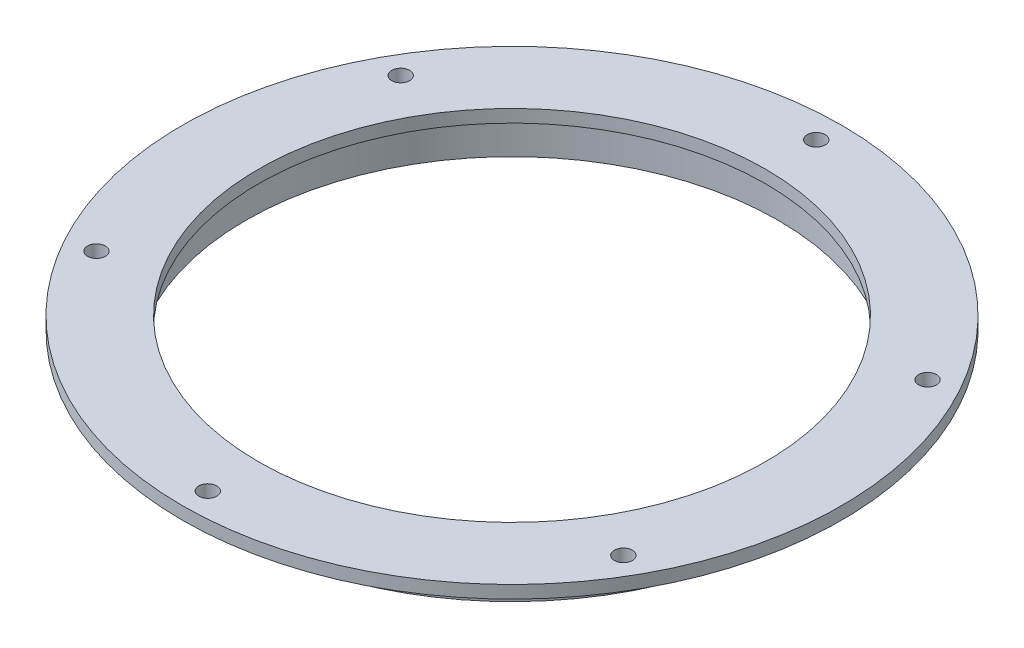
ISO-10303-21;
HEADER;
FILE_DESCRIPTION(('STEP AP214'),'2;1');
FILE_NAME('part.step','',(''),(''),'','','');
FILE_SCHEMA(('AUTOMOTIVE_DESIGN { 1 0 10303 214 1 1 1 1 }'));
ENDSEC;
DATA;
#1=APPLICATION_CONTEXT('core data for automotive mechanical design processes');
#2=APPLICATION_PROTOCOL_DEFINITION('international standard','automotive_design',2000,#1);
#3=PRODUCT_CONTEXT('',#1,'mechanical');
#4=PRODUCT('Part','Part','',(#3));
#5=PRODUCT_RELATED_PRODUCT_CATEGORY('part','',(#4));
#6=PRODUCT_DEFINITION_FORMATION('','',#4);
#7=PRODUCT_DEFINITION_CONTEXT('part definition',#1,'design');
#8=PRODUCT_DEFINITION('design','',#6,#7);
#9=PRODUCT_DEFINITION_SHAPE('','',#8);
#10=(LENGTH_UNIT() NAMED_UNIT(*) SI_UNIT(.MILLI.,.METRE.));
#11=(NAMED_UNIT(*) PLANE_ANGLE_UNIT() SI_UNIT($,.RADIAN.));
#12=(NAMED_UNIT(*) SI_UNIT($,.STERADIAN.) SOLID_ANGLE_UNIT());
#13=UNCERTAINTY_MEASURE_WITH_UNIT(LENGTH_MEASURE(1.E-05),#10,'distance_accuracy_value','');
#14=(GEOMETRIC_REPRESENTATION_CONTEXT(3) GLOBAL_UNCERTAINTY_ASSIGNED_CONTEXT((#13)) GLOBAL_UNIT_ASSIGNED_CONTEXT((#10,
#11,#12)) REPRESENTATION_CONTEXT('',''));
#15=CARTESIAN_POINT('',(0.,0.,0.));
#16=DIRECTION('',(0.,0.,1.));
#17=DIRECTION('',(1.,0.,0.));
#18=AXIS2_PLACEMENT_3D('',#15,#16,#17);
#19=CARTESIAN_POINT('',(0.,0.,0.));
#20=DIRECTION('',(0.,-1.,0.));
#21=DIRECTION('',(0.,0.,-1.));
#22=AXIS2_PLACEMENT_3D('',#19,#20,#21);
#23=CYLINDRICAL_SURFACE('',#22,69.85);
#24=CARTESIAN_POINT('',(0.,9.525,0.));
#25=DIRECTION('',(0.,-1.,0.));
#26=DIRECTION('',(0.,0.,-1.));
#27=AXIS2_PLACEMENT_3D('',#24,#25,#26);
#28=CIRCLE('',#27,69.85);
#29=CARTESIAN_POINT('',(0.,9.525,-69.85));
#30=VERTEX_POINT('',#29);
#31=EDGE_CURVE('E61',#30,#30,#28,.T.);
#32=ORIENTED_EDGE('',*,*,#31,.T.);
#33=EDGE_LOOP('',(#32));
#34=FACE_BOUND('',#33,.T.);
#35=CARTESIAN_POINT('',(0.,0.,0.));
#36=DIRECTION('',(0.,-1.,0.));
#37=DIRECTION('',(0.,0.,-1.));
#38=AXIS2_PLACEMENT_3D('',#35,#36,#37);
#39=CIRCLE('',#38,69.85);
#40=CARTESIAN_POINT('',(0.,0.,-69.85));
#41=VERTEX_POINT('',#40);
#42=EDGE_CURVE('E10',#41,#41,#39,.T.);
#43=ORIENTED_EDGE('',*,*,#42,.F.);
#44=EDGE_LOOP('',(#43));
#45=FACE_BOUND('',#44,.T.);
#46=ADVANCED_FACE('F39',(#34,#45),#23,.T.);
#47=CARTESIAN_POINT('',(0.,0.,-66.675));
#48=DIRECTION('',(0.,-1.,0.));
#49=DIRECTION('',(0.,0.,-1.));
#50=AXIS2_PLACEMENT_3D('',#47,#48,#49);
#51=PLANE('',#50);
#52=ORIENTED_EDGE('',*,*,#42,.T.);
#53=EDGE_LOOP('',(#52));
#54=FACE_BOUND('',#53,.T.);
#55=CARTESIAN_POINT('',(0.,0.,0.));
#56=DIRECTION('',(0.,-1.,0.));
#57=DIRECTION('',(0.,0.,-1.));
#58=AXIS2_PLACEMENT_3D('',#55,#56,#57);
#59=CIRCLE('',#58,66.675);
#60=CARTESIAN_POINT('',(0.,0.,-66.675));
#61=VERTEX_POINT('',#60);
#62=EDGE_CURVE('E45',#61,#61,#59,.T.);
#63=ORIENTED_EDGE('',*,*,#62,.F.);
#64=EDGE_LOOP('',(#63));
#65=FACE_BOUND('',#64,.T.);
#66=ADVANCED_FACE('F144',(#54,#65),#51,.T.);
#67=CARTESIAN_POINT('',(0.,0.,0.));
#68=DIRECTION('',(0.,-1.,0.));
#69=DIRECTION('',(0.,0.,-1.));
#70=AXIS2_PLACEMENT_3D('',#67,#68,#69);
#71=CYLINDRICAL_SURFACE('',#70,66.675);
#72=ORIENTED_EDGE('',*,*,#62,.T.);
#73=EDGE_LOOP('',(#72));
#74=FACE_BOUND('',#73,.T.);
#75=CARTESIAN_POINT('',(0.,9.525,0.));
#76=DIRECTION('',(0.,-1.,0.));
#77=DIRECTION('',(0.,0.,-1.));
#78=AXIS2_PLACEMENT_3D('',#75,#76,#77);
#79=CIRCLE('',#78,66.675);
#80=CARTESIAN_POINT('',(0.,9.525,-66.675));
#81=VERTEX_POINT('',#80);
#82=EDGE_CURVE('E49',#81,#81,#79,.T.);
#83=ORIENTED_EDGE('',*,*,#82,.F.);
#84=EDGE_LOOP('',(#83));
#85=FACE_BOUND('',#84,.T.);
#86=ADVANCED_FACE('F148',(#74,#85),#71,.F.);
#87=CARTESIAN_POINT('',(0.,9.525,0.));
#88=DIRECTION('',(0.,-1.,0.));
#89=DIRECTION('',(0.,0.,-1.));
#90=AXIS2_PLACEMENT_3D('',#87,#88,#89);
#91=PLANE('',#90);
#92=CARTESIAN_POINT('',(0.,9.525,0.));
#93=DIRECTION('',(0.,-1.,0.));
#94=DIRECTION('',(0.,0.,-1.));
#95=AXIS2_PLACEMENT_3D('',#92,#93,#94);
#96=CIRCLE('',#95,63.5);
#97=CARTESIAN_POINT('',(0.,9.525,-63.5));
#98=VERTEX_POINT('',#97);
#99=EDGE_CURVE('E100',#98,#98,#96,.T.);
#100=ORIENTED_EDGE('',*,*,#99,.F.);
#101=EDGE_LOOP('',(#100));
#102=FACE_BOUND('',#101,.T.);
#103=ORIENTED_EDGE('',*,*,#82,.T.);
#104=EDGE_LOOP('',(#103));
#105=FACE_BOUND('',#104,.T.);
#106=ADVANCED_FACE('F113',(#102,#105),#91,.T.);
#107=CARTESIAN_POINT('',(0.,12.7,-82.55));
#108=DIRECTION('',(0.,1.,0.));
#109=DIRECTION('',(0.,0.,1.));
#110=AXIS2_PLACEMENT_3D('',#107,#108,#109);
#111=PLANE('',#110);
#112=CARTESIAN_POINT('',(0.,12.7,0.));
#113=DIRECTION('',(0.,1.,0.));
#114=DIRECTION('',(0.,0.,1.));
#115=AXIS2_PLACEMENT_3D('',#112,#113,#114);
#116=CIRCLE('',#115,63.5);
#117=CARTESIAN_POINT('',(0.,12.7,63.5));
#118=VERTEX_POINT('',#117);
#119=EDGE_CURVE('E103',#118,#118,#116,.T.);
#120=ORIENTED_EDGE('',*,*,#119,.F.);
#121=EDGE_LOOP('',(#120));
#122=FACE_BOUND('',#121,.T.);
#123=CARTESIAN_POINT('',(-65.9911357683738,12.7,-38.1000000000008));
#124=DIRECTION('',(0.,1.,0.));
#125=DIRECTION('',(0.,0.,1.));
#126=AXIS2_PLACEMENT_3D('',#123,#124,#125);
#127=CIRCLE('',#126,2.2479);
#128=CARTESIAN_POINT('',(-65.9911357683738,12.7,-35.8521000000008));
#129=VERTEX_POINT('',#128);
#130=EDGE_CURVE('E97',#129,#129,#127,.T.);
#131=ORIENTED_EDGE('',*,*,#130,.F.);
#132=EDGE_LOOP('',(#131));
#133=FACE_BOUND('',#132,.T.);
#134=CARTESIAN_POINT('',(-65.9911357683746,12.7,38.0999999999994));
#135=DIRECTION('',(0.,1.,0.));
#136=DIRECTION('',(0.,0.,1.));
#137=AXIS2_PLACEMENT_3D('',#134,#135,#136);
#138=CIRCLE('',#137,2.2479);
#139=CARTESIAN_POINT('',(-65.9911357683746,12.7,40.3478999999994));
#140=VERTEX_POINT('',#139);
#141=EDGE_CURVE('E91',#140,#140,#138,.T.);
#142=ORIENTED_EDGE('',*,*,#141,.F.);
#143=EDGE_LOOP('',(#142));
#144=FACE_BOUND('',#143,.T.);
#145=CARTESIAN_POINT('',(0.,12.7,76.2));
#146=DIRECTION('',(0.,1.,0.));
#147=DIRECTION('',(0.,0.,1.));
#148=AXIS2_PLACEMENT_3D('',#145,#146,#147);
#149=CIRCLE('',#148,2.2479);
#150=CARTESIAN_POINT('',(0.,12.7,78.4479));
#151=VERTEX_POINT('',#150);
#152=EDGE_CURVE('E85',#151,#151,#149,.T.);
#153=ORIENTED_EDGE('',*,*,#152,.F.);
#154=EDGE_LOOP('',(#153));
#155=FACE_BOUND('',#154,.T.);
#156=CARTESIAN_POINT('',(65.9911357683741,12.7,38.1000000000003));
#157=DIRECTION('',(0.,1.,0.));
#158=DIRECTION('',(0.,0.,1.));
#159=AXIS2_PLACEMENT_3D('',#156,#157,#158);
#160=CIRCLE('',#159,2.2479);
#161=CARTESIAN_POINT('',(65.9911357683741,12.7,40.3479000000003));
#162=VERTEX_POINT('',#161);
#163=EDGE_CURVE('E79',#162,#162,#160,.T.);
#164=ORIENTED_EDGE('',*,*,#163,.F.);
#165=EDGE_LOOP('',(#164));
#166=FACE_BOUND('',#165,.T.);
#167=CARTESIAN_POINT('',(65.9911357683743,12.7,-38.0999999999999));
#168=DIRECTION('',(0.,1.,0.));
#169=DIRECTION('',(0.,0.,1.));
#170=AXIS2_PLACEMENT_3D('',#167,#168,#169);
#171=CIRCLE('',#170,2.2479);
#172=CARTESIAN_POINT('',(65.9911357683743,12.7,-35.8520999999999));
#173=VERTEX_POINT('',#172);
#174=EDGE_CURVE('E73',#173,#173,#171,.T.);
#175=ORIENTED_EDGE('',*,*,#174,.F.);
#176=EDGE_LOOP('',(#175));
#177=FACE_BOUND('',#176,.T.);
#178=CARTESIAN_POINT('',(0.,12.7,-76.2));
#179=DIRECTION('',(0.,1.,0.));
#180=DIRECTION('',(0.,0.,1.));
#181=AXIS2_PLACEMENT_3D('',#178,#179,#180);
#182=CIRCLE('',#181,2.2479);
#183=CARTESIAN_POINT('',(0.,12.7,-73.9521));
#184=VERTEX_POINT('',#183);
#185=EDGE_CURVE('E67',#184,#184,#182,.T.);
#186=ORIENTED_EDGE('',*,*,#185,.F.);
#187=EDGE_LOOP('',(#186));
#188=FACE_BOUND('',#187,.T.);
#189=CARTESIAN_POINT('',(0.,12.7,0.));
#190=DIRECTION('',(0.,-1.,0.));
#191=DIRECTION('',(0.,0.,-1.));
#192=AXIS2_PLACEMENT_3D('',#189,#190,#191);
#193=CIRCLE('',#192,82.55);
#194=CARTESIAN_POINT('',(0.,12.7,-82.55));
#195=VERTEX_POINT('',#194);
#196=EDGE_CURVE('E53',#195,#195,#193,.T.);
#197=ORIENTED_EDGE('',*,*,#196,.F.);
#198=EDGE_LOOP('',(#197));
#199=FACE_BOUND('',#198,.T.);
#200=ADVANCED_FACE('F109',(#122,#133,#144,#155,#166,#177,#188,#199),#111,.T.);
#201=CARTESIAN_POINT('',(0.,0.,0.));
#202=DIRECTION('',(0.,-1.,0.));
#203=DIRECTION('',(0.,0.,-1.));
#204=AXIS2_PLACEMENT_3D('',#201,#202,#203);
#205=CYLINDRICAL_SURFACE('',#204,82.55);
#206=ORIENTED_EDGE('',*,*,#196,.T.);
#207=EDGE_LOOP('',(#206));
#208=FACE_BOUND('',#207,.T.);
#209=CARTESIAN_POINT('',(0.,9.525,0.));
#210=DIRECTION('',(0.,-1.,0.));
#211=DIRECTION('',(0.,0.,-1.));
#212=AXIS2_PLACEMENT_3D('',#209,#210,#211);
#213=CIRCLE('',#212,82.55);
#214=CARTESIAN_POINT('',(0.,9.525,-82.55));
#215=VERTEX_POINT('',#214);
#216=EDGE_CURVE('E58',#215,#215,#213,.T.);
#217=ORIENTED_EDGE('',*,*,#216,.F.);
#218=EDGE_LOOP('',(#217));
#219=FACE_BOUND('',#218,.T.);
#220=ADVANCED_FACE('F112',(#208,#219),#205,.T.);
#221=CARTESIAN_POINT('',(0.,9.525,-69.85));
#222=DIRECTION('',(0.,-1.,0.));
#223=DIRECTION('',(0.,0.,-1.));
#224=AXIS2_PLACEMENT_3D('',#221,#222,#223);
#225=PLANE('',#224);
#226=CARTESIAN_POINT('',(-65.9911357683738,9.525,-38.1000000000008));
#227=DIRECTION('',(0.,-1.,0.));
#228=DIRECTION('',(0.,0.,-1.));
#229=AXIS2_PLACEMENT_3D('',#226,#227,#228);
#230=CIRCLE('',#229,2.2479);
#231=CARTESIAN_POINT('',(-65.9911357683738,9.525,-40.3479000000008));
#232=VERTEX_POINT('',#231);
#233=EDGE_CURVE('E94',#232,#232,#230,.T.);
#234=ORIENTED_EDGE('',*,*,#233,.F.);
#235=EDGE_LOOP('',(#234));
#236=FACE_BOUND('',#235,.T.);
#237=CARTESIAN_POINT('',(-65.9911357683746,9.525,38.0999999999994));
#238=DIRECTION('',(0.,-1.,0.));
#239=DIRECTION('',(0.,0.,-1.));
#240=AXIS2_PLACEMENT_3D('',#237,#238,#239);
#241=CIRCLE('',#240,2.2479);
#242=CARTESIAN_POINT('',(-65.9911357683746,9.525,35.8520999999994));
#243=VERTEX_POINT('',#242);
#244=EDGE_CURVE('E88',#243,#243,#241,.T.);
#245=ORIENTED_EDGE('',*,*,#244,.F.);
#246=EDGE_LOOP('',(#245));
#247=FACE_BOUND('',#246,.T.);
#248=CARTESIAN_POINT('',(0.,9.525,76.2));
#249=DIRECTION('',(0.,-1.,0.));
#250=DIRECTION('',(0.,0.,-1.));
#251=AXIS2_PLACEMENT_3D('',#248,#249,#250);
#252=CIRCLE('',#251,2.2479);
#253=CARTESIAN_POINT('',(0.,9.525,73.9521));
#254=VERTEX_POINT('',#253);
#255=EDGE_CURVE('E82',#254,#254,#252,.T.);
#256=ORIENTED_EDGE('',*,*,#255,.F.);
#257=EDGE_LOOP('',(#256));
#258=FACE_BOUND('',#257,.T.);
#259=CARTESIAN_POINT('',(65.9911357683741,9.525,38.1000000000003));
#260=DIRECTION('',(0.,-1.,0.));
#261=DIRECTION('',(0.,0.,-1.));
#262=AXIS2_PLACEMENT_3D('',#259,#260,#261);
#263=CIRCLE('',#262,2.2479);
#264=CARTESIAN_POINT('',(65.9911357683741,9.525,35.8521000000003));
#265=VERTEX_POINT('',#264);
#266=EDGE_CURVE('E76',#265,#265,#263,.T.);
#267=ORIENTED_EDGE('',*,*,#266,.F.);
#268=EDGE_LOOP('',(#267));
#269=FACE_BOUND('',#268,.T.);
#270=CARTESIAN_POINT('',(65.9911357683743,9.525,-38.0999999999999));
#271=DIRECTION('',(0.,-1.,0.));
#272=DIRECTION('',(0.,0.,-1.));
#273=AXIS2_PLACEMENT_3D('',#270,#271,#272);
#274=CIRCLE('',#273,2.2479);
#275=CARTESIAN_POINT('',(65.9911357683743,9.525,-40.3478999999998));
#276=VERTEX_POINT('',#275);
#277=EDGE_CURVE('E70',#276,#276,#274,.T.);
#278=ORIENTED_EDGE('',*,*,#277,.F.);
#279=EDGE_LOOP('',(#278));
#280=FACE_BOUND('',#279,.T.);
#281=CARTESIAN_POINT('',(0.,9.525,-76.2));
#282=DIRECTION('',(0.,-1.,0.));
#283=DIRECTION('',(0.,0.,-1.));
#284=AXIS2_PLACEMENT_3D('',#281,#282,#283);
#285=CIRCLE('',#284,2.2479);
#286=CARTESIAN_POINT('',(0.,9.525,-78.4479));
#287=VERTEX_POINT('',#286);
#288=EDGE_CURVE('E64',#287,#287,#285,.T.);
#289=ORIENTED_EDGE('',*,*,#288,.F.);
#290=EDGE_LOOP('',(#289));
#291=FACE_BOUND('',#290,.T.);
#292=ORIENTED_EDGE('',*,*,#216,.T.);
#293=EDGE_LOOP('',(#292));
#294=FACE_BOUND('',#293,.T.);
#295=ORIENTED_EDGE('',*,*,#31,.F.);
#296=EDGE_LOOP('',(#295));
#297=FACE_BOUND('',#296,.T.);
#298=ADVANCED_FACE('F131',(#236,#247,#258,#269,#280,#291,#294,#297),#225,.T.);
#299=CARTESIAN_POINT('',(0.,12.7,-76.2));
#300=DIRECTION('',(0.,1.,0.));
#301=DIRECTION('',(0.,0.,1.));
#302=AXIS2_PLACEMENT_3D('',#299,#300,#301);
#303=CYLINDRICAL_SURFACE('',#302,2.2479);
#304=ORIENTED_EDGE('',*,*,#185,.T.);
#305=EDGE_LOOP('',(#304));
#306=FACE_BOUND('',#305,.T.);
#307=ORIENTED_EDGE('',*,*,#288,.T.);
#308=EDGE_LOOP('',(#307));
#309=FACE_BOUND('',#308,.T.);
#310=ADVANCED_FACE('F137',(#306,#309),#303,.F.);
#311=CARTESIAN_POINT('',(65.9911357683743,12.7,-38.0999999999999));
#312=DIRECTION('',(0.,1.,0.));
#313=DIRECTION('',(0.,0.,1.));
#314=AXIS2_PLACEMENT_3D('',#311,#312,#313);
#315=CYLINDRICAL_SURFACE('',#314,2.2479);
#316=ORIENTED_EDGE('',*,*,#174,.T.);
#317=EDGE_LOOP('',(#316));
#318=FACE_BOUND('',#317,.T.);
#319=ORIENTED_EDGE('',*,*,#277,.T.);
#320=EDGE_LOOP('',(#319));
#321=FACE_BOUND('',#320,.T.);
#322=ADVANCED_FACE('F160',(#318,#321),#315,.F.);
#323=CARTESIAN_POINT('',(65.9911357683741,12.7,38.1000000000003));
#324=DIRECTION('',(0.,1.,0.));
#325=DIRECTION('',(0.,0.,1.));
#326=AXIS2_PLACEMENT_3D('',#323,#324,#325);
#327=CYLINDRICAL_SURFACE('',#326,2.2479);
#328=ORIENTED_EDGE('',*,*,#163,.T.);
#329=EDGE_LOOP('',(#328));
#330=FACE_BOUND('',#329,.T.);
#331=ORIENTED_EDGE('',*,*,#266,.T.);
#332=EDGE_LOOP('',(#331));
#333=FACE_BOUND('',#332,.T.);
#334=ADVANCED_FACE('F164',(#330,#333),#327,.F.);
#335=CARTESIAN_POINT('',(0.,12.7,76.2));
#336=DIRECTION('',(0.,1.,0.));
#337=DIRECTION('',(0.,0.,1.));
#338=AXIS2_PLACEMENT_3D('',#335,#336,#337);
#339=CYLINDRICAL_SURFACE('',#338,2.2479);
#340=ORIENTED_EDGE('',*,*,#152,.T.);
#341=EDGE_LOOP('',(#340));
#342=FACE_BOUND('',#341,.T.);
#343=ORIENTED_EDGE('',*,*,#255,.T.);
#344=EDGE_LOOP('',(#343));
#345=FACE_BOUND('',#344,.T.);
#346=ADVANCED_FACE('F168',(#342,#345),#339,.F.);
#347=CARTESIAN_POINT('',(-65.9911357683746,12.7,38.0999999999994));
#348=DIRECTION('',(0.,1.,0.));
#349=DIRECTION('',(0.,0.,1.));
#350=AXIS2_PLACEMENT_3D('',#347,#348,#349);
#351=CYLINDRICAL_SURFACE('',#350,2.2479);
#352=ORIENTED_EDGE('',*,*,#141,.T.);
#353=EDGE_LOOP('',(#352));
#354=FACE_BOUND('',#353,.T.);
#355=ORIENTED_EDGE('',*,*,#244,.T.);
#356=EDGE_LOOP('',(#355));
#357=FACE_BOUND('',#356,.T.);
#358=ADVANCED_FACE('F172',(#354,#357),#351,.F.);
#359=CARTESIAN_POINT('',(-65.9911357683738,12.7,-38.1000000000008));
#360=DIRECTION('',(0.,1.,0.));
#361=DIRECTION('',(0.,0.,1.));
#362=AXIS2_PLACEMENT_3D('',#359,#360,#361);
#363=CYLINDRICAL_SURFACE('',#362,2.2479);
#364=ORIENTED_EDGE('',*,*,#130,.T.);
#365=EDGE_LOOP('',(#364));
#366=FACE_BOUND('',#365,.T.);
#367=ORIENTED_EDGE('',*,*,#233,.T.);
#368=EDGE_LOOP('',(#367));
#369=FACE_BOUND('',#368,.T.);
#370=ADVANCED_FACE('F176',(#366,#369),#363,.F.);
#371=CARTESIAN_POINT('',(0.,0.,0.));
#372=DIRECTION('',(0.,1.,0.));
#373=DIRECTION('',(0.,0.,1.));
#374=AXIS2_PLACEMENT_3D('',#371,#372,#373);
#375=CYLINDRICAL_SURFACE('',#374,63.5);
#376=ORIENTED_EDGE('',*,*,#99,.T.);
#377=EDGE_LOOP('',(#376));
#378=FACE_BOUND('',#377,.T.);
#379=ORIENTED_EDGE('',*,*,#119,.T.);
#380=EDGE_LOOP('',(#379));
#381=FACE_BOUND('',#380,.T.);
#382=ADVANCED_FACE('F107',(#378,#381),#375,.F.);
#383=CLOSED_SHELL('',(#46,#66,#86,#106,#200,#220,#298,#310,#322,#334,#346,#358,#370,#382));
#384=MANIFOLD_SOLID_BREP('B2',#383);
#385=ADVANCED_BREP_SHAPE_REPRESENTATION('',(#18,#384),#14);
#386=SHAPE_DEFINITION_REPRESENTATION(#9,#385);
ENDSEC;
END-ISO-10303-21;
